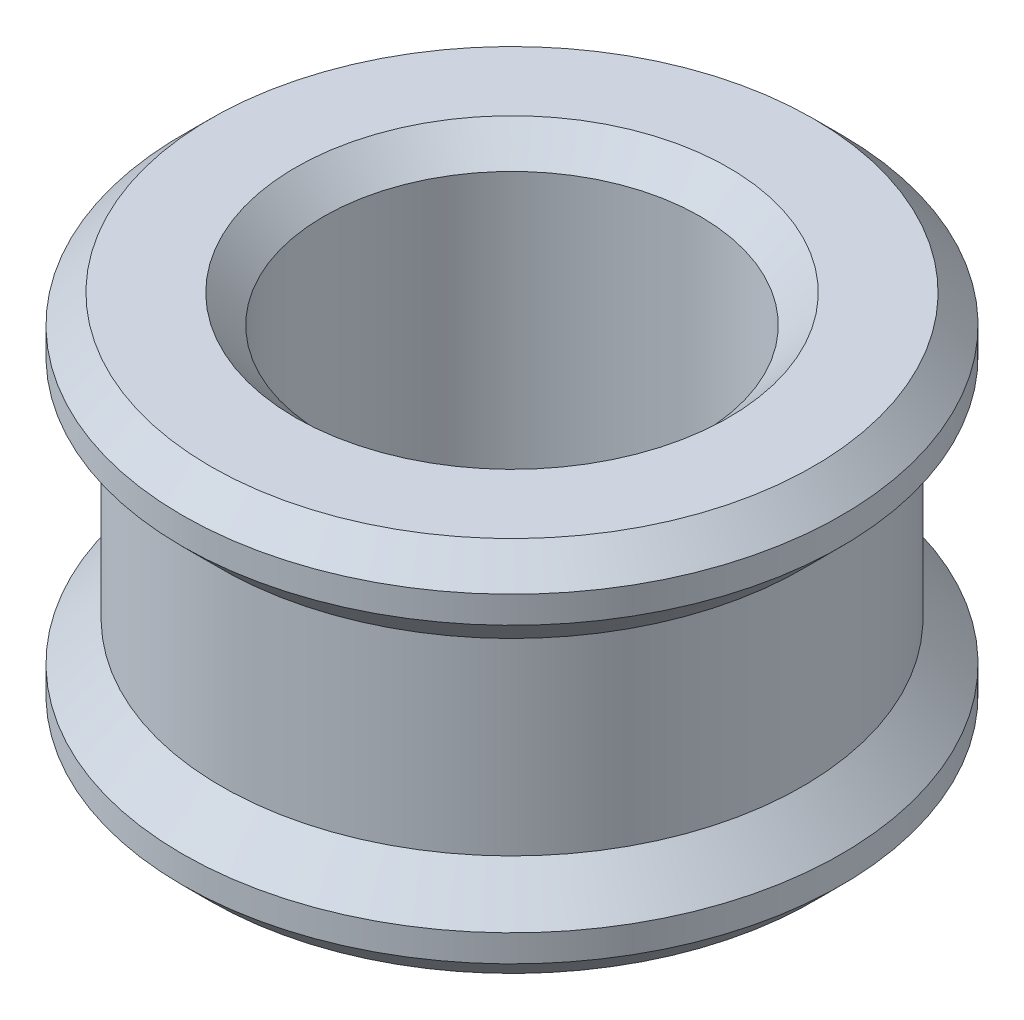
ISO-10303-21;
HEADER;
FILE_DESCRIPTION(('STEP AP214'),'2;1');
FILE_NAME('part.step','',(''),(''),'','','');
FILE_SCHEMA(('AUTOMOTIVE_DESIGN { 1 0 10303 214 1 1 1 1 }'));
ENDSEC;
DATA;
#1=APPLICATION_CONTEXT('core data for automotive mechanical design processes');
#2=APPLICATION_PROTOCOL_DEFINITION('international standard','automotive_design',2000,#1);
#3=PRODUCT_CONTEXT('',#1,'mechanical');
#4=PRODUCT('Part','Part','',(#3));
#5=PRODUCT_RELATED_PRODUCT_CATEGORY('part','',(#4));
#6=PRODUCT_DEFINITION_FORMATION('','',#4);
#7=PRODUCT_DEFINITION_CONTEXT('part definition',#1,'design');
#8=PRODUCT_DEFINITION('design','',#6,#7);
#9=PRODUCT_DEFINITION_SHAPE('','',#8);
#10=(LENGTH_UNIT() NAMED_UNIT(*) SI_UNIT(.MILLI.,.METRE.));
#11=(NAMED_UNIT(*) PLANE_ANGLE_UNIT() SI_UNIT($,.RADIAN.));
#12=(NAMED_UNIT(*) SI_UNIT($,.STERADIAN.) SOLID_ANGLE_UNIT());
#13=UNCERTAINTY_MEASURE_WITH_UNIT(LENGTH_MEASURE(1.E-05),#10,'distance_accuracy_value','');
#14=(GEOMETRIC_REPRESENTATION_CONTEXT(3) GLOBAL_UNCERTAINTY_ASSIGNED_CONTEXT((#13)) GLOBAL_UNIT_ASSIGNED_CONTEXT((#10,
#11,#12)) REPRESENTATION_CONTEXT('',''));
#15=CARTESIAN_POINT('',(0.,0.,0.));
#16=DIRECTION('',(0.,0.,1.));
#17=DIRECTION('',(1.,0.,0.));
#18=AXIS2_PLACEMENT_3D('',#15,#16,#17);
#19=CARTESIAN_POINT('',(3.49999999999999,0.,0.));
#20=DIRECTION('',(0.,-1.,0.));
#21=DIRECTION('',(0.,0.,-1.));
#22=AXIS2_PLACEMENT_3D('',#19,#20,#21);
#23=PLANE('',#22);
#24=CARTESIAN_POINT('',(0.,0.,0.));
#25=DIRECTION('',(0.,-1.,0.));
#26=DIRECTION('',(0.,0.,-1.));
#27=AXIS2_PLACEMENT_3D('',#24,#25,#26);
#28=CIRCLE('',#27,2.3);
#29=CARTESIAN_POINT('',(0.,0.,-2.3));
#30=VERTEX_POINT('',#29);
#31=EDGE_CURVE('E44',#30,#30,#28,.F.);
#32=ORIENTED_EDGE('',*,*,#31,.T.);
#33=EDGE_LOOP('',(#32));
#34=FACE_BOUND('',#33,.T.);
#35=CARTESIAN_POINT('',(0.,0.,0.));
#36=DIRECTION('',(0.,-1.,0.));
#37=DIRECTION('',(0.,0.,-1.));
#38=AXIS2_PLACEMENT_3D('',#35,#36,#37);
#39=CIRCLE('',#38,3.19999999999999);
#40=CARTESIAN_POINT('',(0.,0.,-3.19999999999999));
#41=VERTEX_POINT('',#40);
#42=EDGE_CURVE('E48',#41,#41,#39,.T.);
#43=ORIENTED_EDGE('',*,*,#42,.T.);
#44=EDGE_LOOP('',(#43));
#45=FACE_BOUND('',#44,.T.);
#46=ADVANCED_FACE('F32',(#34,#45),#23,.T.);
#47=CARTESIAN_POINT('',(0.,0.,0.));
#48=DIRECTION('',(0.,-1.,0.));
#49=DIRECTION('',(0.,0.,-1.));
#50=AXIS2_PLACEMENT_3D('',#47,#48,#49);
#51=CYLINDRICAL_SURFACE('',#50,2.);
#52=CARTESIAN_POINT('',(0.,3.7,0.));
#53=DIRECTION('',(0.,1.,0.));
#54=DIRECTION('',(0.,0.,1.));
#55=AXIS2_PLACEMENT_3D('',#52,#53,#54);
#56=CIRCLE('',#55,2.);
#57=CARTESIAN_POINT('',(0.,3.7,2.));
#58=VERTEX_POINT('',#57);
#59=EDGE_CURVE('E53',#58,#58,#56,.T.);
#60=ORIENTED_EDGE('',*,*,#59,.T.);
#61=EDGE_LOOP('',(#60));
#62=FACE_BOUND('',#61,.T.);
#63=CARTESIAN_POINT('',(0.,0.299999999999999,0.));
#64=DIRECTION('',(0.,-1.,0.));
#65=DIRECTION('',(0.,0.,-1.));
#66=AXIS2_PLACEMENT_3D('',#63,#64,#65);
#67=CIRCLE('',#66,2.);
#68=CARTESIAN_POINT('',(0.,0.299999999999999,-2.));
#69=VERTEX_POINT('',#68);
#70=EDGE_CURVE('E56',#69,#69,#67,.T.);
#71=ORIENTED_EDGE('',*,*,#70,.T.);
#72=EDGE_LOOP('',(#71));
#73=FACE_BOUND('',#72,.T.);
#74=ADVANCED_FACE('F95',(#62,#73),#51,.F.);
#75=CARTESIAN_POINT('',(2.,4.,0.));
#76=DIRECTION('',(0.,1.,0.));
#77=DIRECTION('',(0.,0.,1.));
#78=AXIS2_PLACEMENT_3D('',#75,#76,#77);
#79=PLANE('',#78);
#80=CARTESIAN_POINT('',(0.,4.,0.));
#81=DIRECTION('',(0.,1.,0.));
#82=DIRECTION('',(0.,0.,1.));
#83=AXIS2_PLACEMENT_3D('',#80,#81,#82);
#84=CIRCLE('',#83,2.3);
#85=CARTESIAN_POINT('',(0.,4.,2.3));
#86=VERTEX_POINT('',#85);
#87=EDGE_CURVE('E59',#86,#86,#84,.F.);
#88=ORIENTED_EDGE('',*,*,#87,.T.);
#89=EDGE_LOOP('',(#88));
#90=FACE_BOUND('',#89,.T.);
#91=CARTESIAN_POINT('',(0.,4.,0.));
#92=DIRECTION('',(0.,1.,0.));
#93=DIRECTION('',(0.,0.,1.));
#94=AXIS2_PLACEMENT_3D('',#91,#92,#93);
#95=CIRCLE('',#94,3.2);
#96=CARTESIAN_POINT('',(0.,4.,3.2));
#97=VERTEX_POINT('',#96);
#98=EDGE_CURVE('E62',#97,#97,#95,.T.);
#99=ORIENTED_EDGE('',*,*,#98,.T.);
#100=EDGE_LOOP('',(#99));
#101=FACE_BOUND('',#100,.T.);
#102=ADVANCED_FACE('F101',(#90,#101),#79,.T.);
#103=CARTESIAN_POINT('',(0.,0.,0.));
#104=DIRECTION('',(0.,-1.,0.));
#105=DIRECTION('',(0.,0.,-1.));
#106=AXIS2_PLACEMENT_3D('',#103,#104,#105);
#107=CYLINDRICAL_SURFACE('',#106,3.5);
#108=CARTESIAN_POINT('',(0.,3.7,0.));
#109=DIRECTION('',(0.,1.,0.));
#110=DIRECTION('',(0.,0.,1.));
#111=AXIS2_PLACEMENT_3D('',#108,#109,#110);
#112=CIRCLE('',#111,3.5);
#113=CARTESIAN_POINT('',(0.,3.7,3.5));
#114=VERTEX_POINT('',#113);
#115=EDGE_CURVE('E10',#114,#114,#112,.F.);
#116=ORIENTED_EDGE('',*,*,#115,.T.);
#117=EDGE_LOOP('',(#116));
#118=FACE_BOUND('',#117,.T.);
#119=CARTESIAN_POINT('',(0.,3.4142135623731,0.));
#120=DIRECTION('',(0.,-1.,0.));
#121=DIRECTION('',(0.,0.,-1.));
#122=AXIS2_PLACEMENT_3D('',#119,#120,#121);
#123=CIRCLE('',#122,3.5);
#124=CARTESIAN_POINT('',(0.,3.4142135623731,-3.5));
#125=VERTEX_POINT('',#124);
#126=EDGE_CURVE('E65',#125,#125,#123,.T.);
#127=ORIENTED_EDGE('',*,*,#126,.F.);
#128=EDGE_LOOP('',(#127));
#129=FACE_BOUND('',#128,.T.);
#130=ADVANCED_FACE('F137',(#118,#129),#107,.T.);
#131=CARTESIAN_POINT('',(0.,3.,0.));
#132=DIRECTION('',(0.,1.,0.));
#133=DIRECTION('',(0.,0.,1.));
#134=AXIS2_PLACEMENT_3D('',#131,#132,#133);
#135=CONICAL_SURFACE('',#134,3.0857864376269,0.78539816339745);
#136=ORIENTED_EDGE('',*,*,#126,.T.);
#137=EDGE_LOOP('',(#136));
#138=FACE_BOUND('',#137,.T.);
#139=CARTESIAN_POINT('',(0.,3.,0.));
#140=DIRECTION('',(0.,-1.,0.));
#141=DIRECTION('',(0.,0.,-1.));
#142=AXIS2_PLACEMENT_3D('',#139,#140,#141);
#143=CIRCLE('',#142,3.0857864376269);
#144=CARTESIAN_POINT('',(0.,3.,-3.0857864376269));
#145=VERTEX_POINT('',#144);
#146=EDGE_CURVE('E68',#145,#145,#143,.T.);
#147=ORIENTED_EDGE('',*,*,#146,.F.);
#148=EDGE_LOOP('',(#147));
#149=FACE_BOUND('',#148,.T.);
#150=ADVANCED_FACE('F91',(#138,#149),#135,.T.);
#151=CARTESIAN_POINT('',(0.,0.,0.));
#152=DIRECTION('',(0.,-1.,0.));
#153=DIRECTION('',(0.,0.,-1.));
#154=AXIS2_PLACEMENT_3D('',#151,#152,#153);
#155=CYLINDRICAL_SURFACE('',#154,3.0857864376269);
#156=ORIENTED_EDGE('',*,*,#146,.T.);
#157=EDGE_LOOP('',(#156));
#158=FACE_BOUND('',#157,.T.);
#159=CARTESIAN_POINT('',(0.,1.,0.));
#160=DIRECTION('',(0.,-1.,0.));
#161=DIRECTION('',(0.,0.,-1.));
#162=AXIS2_PLACEMENT_3D('',#159,#160,#161);
#163=CIRCLE('',#162,3.0857864376269);
#164=CARTESIAN_POINT('',(0.,1.,-3.0857864376269));
#165=VERTEX_POINT('',#164);
#166=EDGE_CURVE('E71',#165,#165,#163,.T.);
#167=ORIENTED_EDGE('',*,*,#166,.F.);
#168=EDGE_LOOP('',(#167));
#169=FACE_BOUND('',#168,.T.);
#170=ADVANCED_FACE('F82',(#158,#169),#155,.T.);
#171=CARTESIAN_POINT('',(0.,0.585786437626905,0.));
#172=DIRECTION('',(0.,-1.,0.));
#173=DIRECTION('',(0.,0.,-1.));
#174=AXIS2_PLACEMENT_3D('',#171,#172,#173);
#175=CONICAL_SURFACE('',#174,3.5,0.785398163397446);
#176=ORIENTED_EDGE('',*,*,#166,.T.);
#177=EDGE_LOOP('',(#176));
#178=FACE_BOUND('',#177,.T.);
#179=CARTESIAN_POINT('',(0.,0.585786437626905,0.));
#180=DIRECTION('',(0.,-1.,0.));
#181=DIRECTION('',(0.,0.,-1.));
#182=AXIS2_PLACEMENT_3D('',#179,#180,#181);
#183=CIRCLE('',#182,3.5);
#184=CARTESIAN_POINT('',(0.,0.585786437626905,-3.5));
#185=VERTEX_POINT('',#184);
#186=EDGE_CURVE('E74',#185,#185,#183,.T.);
#187=ORIENTED_EDGE('',*,*,#186,.F.);
#188=EDGE_LOOP('',(#187));
#189=FACE_BOUND('',#188,.T.);
#190=ADVANCED_FACE('F80',(#178,#189),#175,.T.);
#191=CARTESIAN_POINT('',(0.,0.,0.));
#192=DIRECTION('',(0.,-1.,0.));
#193=DIRECTION('',(0.,0.,-1.));
#194=AXIS2_PLACEMENT_3D('',#191,#192,#193);
#195=CYLINDRICAL_SURFACE('',#194,3.5);
#196=CARTESIAN_POINT('',(0.,0.300000000000001,0.));
#197=DIRECTION('',(0.,-1.,0.));
#198=DIRECTION('',(0.,0.,-1.));
#199=AXIS2_PLACEMENT_3D('',#196,#197,#198);
#200=CIRCLE('',#199,3.5);
#201=CARTESIAN_POINT('',(0.,0.300000000000001,-3.5));
#202=VERTEX_POINT('',#201);
#203=EDGE_CURVE('E40',#202,#202,#200,.F.);
#204=ORIENTED_EDGE('',*,*,#203,.T.);
#205=EDGE_LOOP('',(#204));
#206=FACE_BOUND('',#205,.T.);
#207=ORIENTED_EDGE('',*,*,#186,.T.);
#208=EDGE_LOOP('',(#207));
#209=FACE_BOUND('',#208,.T.);
#210=ADVANCED_FACE('F78',(#206,#209),#195,.T.);
#211=CARTESIAN_POINT('',(0.,4.,0.));
#212=DIRECTION('',(0.,1.,0.));
#213=DIRECTION('',(0.,0.,1.));
#214=AXIS2_PLACEMENT_3D('',#211,#212,#213);
#215=CONICAL_SURFACE('',#214,2.3,0.785398163397447);
#216=ORIENTED_EDGE('',*,*,#59,.F.);
#217=EDGE_LOOP('',(#216));
#218=FACE_BOUND('',#217,.T.);
#219=ORIENTED_EDGE('',*,*,#87,.F.);
#220=EDGE_LOOP('',(#219));
#221=FACE_BOUND('',#220,.T.);
#222=ADVANCED_FACE('F89',(#218,#221),#215,.F.);
#223=CARTESIAN_POINT('',(0.,0.299999999999999,0.));
#224=DIRECTION('',(0.,-1.,0.));
#225=DIRECTION('',(0.,0.,-1.));
#226=AXIS2_PLACEMENT_3D('',#223,#224,#225);
#227=CONICAL_SURFACE('',#226,2.,0.785398163397451);
#228=ORIENTED_EDGE('',*,*,#31,.F.);
#229=EDGE_LOOP('',(#228));
#230=FACE_BOUND('',#229,.T.);
#231=ORIENTED_EDGE('',*,*,#70,.F.);
#232=EDGE_LOOP('',(#231));
#233=FACE_BOUND('',#232,.T.);
#234=ADVANCED_FACE('F113',(#230,#233),#227,.F.);
#235=CARTESIAN_POINT('',(0.,0.,0.));
#236=DIRECTION('',(0.,1.,0.));
#237=DIRECTION('',(0.,0.,1.));
#238=AXIS2_PLACEMENT_3D('',#235,#236,#237);
#239=CONICAL_SURFACE('',#238,3.19999999999999,0.785398163397447);
#240=ORIENTED_EDGE('',*,*,#203,.F.);
#241=EDGE_LOOP('',(#240));
#242=FACE_BOUND('',#241,.T.);
#243=ORIENTED_EDGE('',*,*,#42,.F.);
#244=EDGE_LOOP('',(#243));
#245=FACE_BOUND('',#244,.T.);
#246=ADVANCED_FACE('F119',(#242,#245),#239,.T.);
#247=CARTESIAN_POINT('',(0.,3.7,0.));
#248=DIRECTION('',(0.,-1.,0.));
#249=DIRECTION('',(0.,0.,-1.));
#250=AXIS2_PLACEMENT_3D('',#247,#248,#249);
#251=CONICAL_SURFACE('',#250,3.5,0.785398163397449);
#252=ORIENTED_EDGE('',*,*,#98,.F.);
#253=EDGE_LOOP('',(#252));
#254=FACE_BOUND('',#253,.T.);
#255=ORIENTED_EDGE('',*,*,#115,.F.);
#256=EDGE_LOOP('',(#255));
#257=FACE_BOUND('',#256,.T.);
#258=ADVANCED_FACE('F35',(#254,#257),#251,.T.);
#259=CLOSED_SHELL('',(#46,#74,#102,#130,#150,#170,#190,#210,#222,#234,#246,#258));
#260=MANIFOLD_SOLID_BREP('B2',#259);
#261=ADVANCED_BREP_SHAPE_REPRESENTATION('',(#18,#260),#14);
#262=SHAPE_DEFINITION_REPRESENTATION(#9,#261);
ENDSEC;
END-ISO-10303-21;
